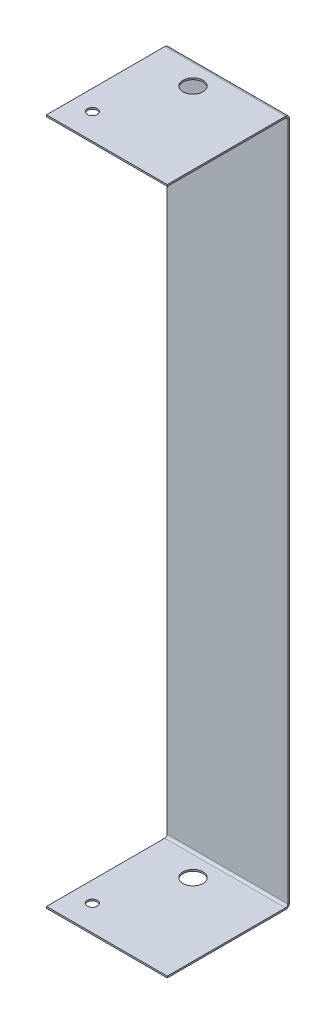
ISO-10303-21;
HEADER;
FILE_DESCRIPTION(('STEP AP214'),'2;1');
FILE_NAME('part.step','',(''),(''),'','','');
FILE_SCHEMA(('AUTOMOTIVE_DESIGN { 1 0 10303 214 1 1 1 1 }'));
ENDSEC;
DATA;
#1=APPLICATION_CONTEXT('core data for automotive mechanical design processes');
#2=APPLICATION_PROTOCOL_DEFINITION('international standard','automotive_design',2000,#1);
#3=PRODUCT_CONTEXT('',#1,'mechanical');
#4=PRODUCT('Part','Part','',(#3));
#5=PRODUCT_RELATED_PRODUCT_CATEGORY('part','',(#4));
#6=PRODUCT_DEFINITION_FORMATION('','',#4);
#7=PRODUCT_DEFINITION_CONTEXT('part definition',#1,'design');
#8=PRODUCT_DEFINITION('design','',#6,#7);
#9=PRODUCT_DEFINITION_SHAPE('','',#8);
#10=(LENGTH_UNIT() NAMED_UNIT(*) SI_UNIT(.MILLI.,.METRE.));
#11=(NAMED_UNIT(*) PLANE_ANGLE_UNIT() SI_UNIT($,.RADIAN.));
#12=(NAMED_UNIT(*) SI_UNIT($,.STERADIAN.) SOLID_ANGLE_UNIT());
#13=UNCERTAINTY_MEASURE_WITH_UNIT(LENGTH_MEASURE(1.E-05),#10,'distance_accuracy_value','');
#14=(GEOMETRIC_REPRESENTATION_CONTEXT(3) GLOBAL_UNCERTAINTY_ASSIGNED_CONTEXT((#13)) GLOBAL_UNIT_ASSIGNED_CONTEXT((#10,
#11,#12)) REPRESENTATION_CONTEXT('',''));
#15=CARTESIAN_POINT('',(0.,0.,0.));
#16=DIRECTION('',(0.,0.,1.));
#17=DIRECTION('',(1.,0.,0.));
#18=AXIS2_PLACEMENT_3D('',#15,#16,#17);
#19=CARTESIAN_POINT('',(0.,-107.908584579339,-107.991415420661));
#20=DIRECTION('',(0.,-1.,0.));
#21=DIRECTION('',(-1.,0.,0.));
#22=AXIS2_PLACEMENT_3D('',#19,#20,#21);
#23=PLANE('',#22);
#24=CARTESIAN_POINT('',(-3.80999999999362,-107.908584579338,7.08660000000422));
#25=DIRECTION('',(0.,1.,0.));
#26=DIRECTION('',(0.,0.,1.));
#27=AXIS2_PLACEMENT_3D('',#24,#25,#26);
#28=CIRCLE('',#27,3.17499999999999);
#29=CARTESIAN_POINT('',(-3.80999999999362,-107.908584579338,10.2616000000042));
#30=VERTEX_POINT('',#29);
#31=EDGE_CURVE('E341',#30,#30,#28,.T.);
#32=ORIENTED_EDGE('',*,*,#31,.F.);
#33=EDGE_LOOP('',(#32));
#34=FACE_BOUND('',#33,.T.);
#35=DIRECTION('',(0.,0.,-1.));
#36=VECTOR('',#35,1.);
#37=CARTESIAN_POINT('',(19.0499999999999,-107.908584579338,38.0585845793383));
#38=LINE('',#37,#36);
#39=CARTESIAN_POINT('',(19.0499999999999,-107.908584579338,38.0585845793383));
#40=VERTEX_POINT('',#39);
#41=CARTESIAN_POINT('',(19.0499999999999,-107.908584579338,0.736599999999948));
#42=VERTEX_POINT('',#41);
#43=EDGE_CURVE('E312',#40,#42,#38,.T.);
#44=ORIENTED_EDGE('',*,*,#43,.T.);
#45=DIRECTION('',(-1.,0.,0.));
#46=VECTOR('',#45,1.);
#47=CARTESIAN_POINT('',(0.,-107.908584579338,0.736599999999948));
#48=LINE('',#47,#46);
#49=CARTESIAN_POINT('',(-19.0500000000001,-107.908584579338,0.736600000000004));
#50=VERTEX_POINT('',#49);
#51=EDGE_CURVE('E319',#42,#50,#48,.T.);
#52=ORIENTED_EDGE('',*,*,#51,.T.);
#53=DIRECTION('',(0.,0.,1.));
#54=VECTOR('',#53,1.);
#55=CARTESIAN_POINT('',(-19.0500000000001,-107.908584579338,38.0585845793384));
#56=LINE('',#55,#54);
#57=CARTESIAN_POINT('',(-19.0500000000001,-107.908584579338,38.0585845793384));
#58=VERTEX_POINT('',#57);
#59=EDGE_CURVE('E321',#50,#58,#56,.T.);
#60=ORIENTED_EDGE('',*,*,#59,.T.);
#61=DIRECTION('',(1.,0.,0.));
#62=VECTOR('',#61,1.);
#63=CARTESIAN_POINT('',(-19.0500000000001,-107.908584579338,38.0585845793384));
#64=LINE('',#63,#62);
#65=EDGE_CURVE('E162',#58,#40,#64,.T.);
#66=ORIENTED_EDGE('',*,*,#65,.T.);
#67=EDGE_LOOP('',(#44,#52,#60,#66));
#68=FACE_BOUND('',#67,.T.);
#69=CARTESIAN_POINT('',(-12.6999999999977,-107.908584579338,29.9465999999943));
#70=DIRECTION('',(0.,1.,0.));
#71=DIRECTION('',(0.,0.,1.));
#72=AXIS2_PLACEMENT_3D('',#69,#70,#71);
#73=CIRCLE('',#72,1.58749999999999);
#74=CARTESIAN_POINT('',(-12.6999999999977,-107.908584579338,31.5340999999943));
#75=VERTEX_POINT('',#74);
#76=EDGE_CURVE('E347',#75,#75,#73,.T.);
#77=ORIENTED_EDGE('',*,*,#76,.F.);
#78=EDGE_LOOP('',(#77));
#79=FACE_BOUND('',#78,.T.);
#80=ADVANCED_FACE('F60',(#34,#68,#79),#23,.F.);
#81=CARTESIAN_POINT('',(0.,0.,-0.508000000000008));
#82=DIRECTION('',(0.,0.,-1.));
#83=DIRECTION('',(-1.,0.,0.));
#84=AXIS2_PLACEMENT_3D('',#81,#82,#83);
#85=PLANE('',#84);
#86=DIRECTION('',(0.,1.,0.));
#87=VECTOR('',#86,1.);
#88=CARTESIAN_POINT('',(19.0499999999999,-146.05,-0.508000000000064));
#89=LINE('',#88,#87);
#90=CARTESIAN_POINT('',(19.0499999999999,-107.171984579338,-0.508000000000064));
#91=VERTEX_POINT('',#90);
#92=CARTESIAN_POINT('',(19.0499999999999,107.171984579338,-0.508000000000064));
#93=VERTEX_POINT('',#92);
#94=EDGE_CURVE('E64',#91,#93,#89,.T.);
#95=ORIENTED_EDGE('',*,*,#94,.F.);
#96=DIRECTION('',(-1.,0.,0.));
#97=VECTOR('',#96,1.);
#98=CARTESIAN_POINT('',(0.,-107.171984579338,-0.508000000000064));
#99=LINE('',#98,#97);
#100=CARTESIAN_POINT('',(-19.0500000000001,-107.171984579338,-0.508000000000008));
#101=VERTEX_POINT('',#100);
#102=EDGE_CURVE('E245',#91,#101,#99,.T.);
#103=ORIENTED_EDGE('',*,*,#102,.T.);
#104=DIRECTION('',(0.,-1.,0.));
#105=VECTOR('',#104,1.);
#106=CARTESIAN_POINT('',(-19.0500000000001,-146.05,-0.508000000000008));
#107=LINE('',#106,#105);
#108=CARTESIAN_POINT('',(-19.0500000000001,107.171984579338,-0.508000000000008));
#109=VERTEX_POINT('',#108);
#110=EDGE_CURVE('E251',#109,#101,#107,.T.);
#111=ORIENTED_EDGE('',*,*,#110,.F.);
#112=DIRECTION('',(-1.,0.,0.));
#113=VECTOR('',#112,1.);
#114=CARTESIAN_POINT('',(0.,107.171984579338,-0.508000000000008));
#115=LINE('',#114,#113);
#116=EDGE_CURVE('E202',#93,#109,#115,.T.);
#117=ORIENTED_EDGE('',*,*,#116,.F.);
#118=EDGE_LOOP('',(#95,#103,#111,#117));
#119=FACE_BOUND('',#118,.T.);
#120=ADVANCED_FACE('F272',(#119),#85,.T.);
#121=CARTESIAN_POINT('',(19.0499999999999,-146.05,-0.508000000000064));
#122=DIRECTION('',(1.,0.,0.));
#123=DIRECTION('',(0.,0.,-1.));
#124=AXIS2_PLACEMENT_3D('',#121,#122,#123);
#125=PLANE('',#124);
#126=DIRECTION('',(0.,1.,0.));
#127=VECTOR('',#126,1.);
#128=CARTESIAN_POINT('',(19.0499999999999,-146.05,0.));
#129=LINE('',#128,#127);
#130=CARTESIAN_POINT('',(19.0499999999999,-107.171984579338,0.));
#131=VERTEX_POINT('',#130);
#132=CARTESIAN_POINT('',(19.05,107.171984579338,0.));
#133=VERTEX_POINT('',#132);
#134=EDGE_CURVE('E211',#131,#133,#129,.T.);
#135=ORIENTED_EDGE('',*,*,#134,.F.);
#136=DIRECTION('',(0.,0.,-1.));
#137=VECTOR('',#136,1.);
#138=CARTESIAN_POINT('',(19.0499999999999,-107.171984579338,-0.507999999999814));
#139=LINE('',#138,#137);
#140=EDGE_CURVE('E255',#131,#91,#139,.T.);
#141=ORIENTED_EDGE('',*,*,#140,.T.);
#142=ORIENTED_EDGE('',*,*,#94,.T.);
#143=DIRECTION('',(0.,0.,-1.));
#144=VECTOR('',#143,1.);
#145=CARTESIAN_POINT('',(19.0499999999999,107.171984579338,-0.507999999998315));
#146=LINE('',#145,#144);
#147=EDGE_CURVE('E212',#133,#93,#146,.T.);
#148=ORIENTED_EDGE('',*,*,#147,.F.);
#149=EDGE_LOOP('',(#135,#141,#142,#148));
#150=FACE_BOUND('',#149,.T.);
#151=ADVANCED_FACE('F269',(#150),#125,.T.);
#152=CARTESIAN_POINT('',(-19.0500000000001,-146.05,-0.508000000000008));
#153=DIRECTION('',(-1.,0.,0.));
#154=DIRECTION('',(0.,0.,1.));
#155=AXIS2_PLACEMENT_3D('',#152,#153,#154);
#156=PLANE('',#155);
#157=ORIENTED_EDGE('',*,*,#110,.T.);
#158=DIRECTION('',(0.,0.,1.));
#159=VECTOR('',#158,1.);
#160=CARTESIAN_POINT('',(-19.0500000000001,-107.171984579338,-0.507999999999731));
#161=LINE('',#160,#159);
#162=CARTESIAN_POINT('',(-19.0500000000001,-107.171984579338,0.));
#163=VERTEX_POINT('',#162);
#164=EDGE_CURVE('E14',#101,#163,#161,.T.);
#165=ORIENTED_EDGE('',*,*,#164,.T.);
#166=DIRECTION('',(0.,-1.,0.));
#167=VECTOR('',#166,1.);
#168=CARTESIAN_POINT('',(-19.0500000000001,-146.05,0.));
#169=LINE('',#168,#167);
#170=CARTESIAN_POINT('',(-19.05,107.171984579338,0.));
#171=VERTEX_POINT('',#170);
#172=EDGE_CURVE('E210',#171,#163,#169,.T.);
#173=ORIENTED_EDGE('',*,*,#172,.F.);
#174=DIRECTION('',(0.,0.,1.));
#175=VECTOR('',#174,1.);
#176=CARTESIAN_POINT('',(-19.0500000000001,107.171984579338,-0.507999999998232));
#177=LINE('',#176,#175);
#178=EDGE_CURVE('E215',#109,#171,#177,.T.);
#179=ORIENTED_EDGE('',*,*,#178,.F.);
#180=EDGE_LOOP('',(#157,#165,#173,#179));
#181=FACE_BOUND('',#180,.T.);
#182=ADVANCED_FACE('F62',(#181),#156,.T.);
#183=CARTESIAN_POINT('',(19.05,108.416584579339,-254.041415420661));
#184=DIRECTION('',(1.,0.,0.));
#185=DIRECTION('',(0.,1.,0.));
#186=AXIS2_PLACEMENT_3D('',#183,#184,#185);
#187=PLANE('',#186);
#188=DIRECTION('',(0.,0.,1.));
#189=VECTOR('',#188,1.);
#190=CARTESIAN_POINT('',(19.05,107.908584579339,-254.041415420661));
#191=LINE('',#190,#189);
#192=CARTESIAN_POINT('',(19.05,107.908584579338,0.736599999999948));
#193=VERTEX_POINT('',#192);
#194=CARTESIAN_POINT('',(19.05,107.908584579338,38.0585845793385));
#195=VERTEX_POINT('',#194);
#196=EDGE_CURVE('E228',#193,#195,#191,.T.);
#197=ORIENTED_EDGE('',*,*,#196,.F.);
#198=DIRECTION('',(0.,1.,0.));
#199=VECTOR('',#198,1.);
#200=CARTESIAN_POINT('',(19.05,108.416584579337,0.736600000000004));
#201=LINE('',#200,#199);
#202=CARTESIAN_POINT('',(19.05,108.416584579338,0.736600000000032));
#203=VERTEX_POINT('',#202);
#204=EDGE_CURVE('E237',#193,#203,#201,.T.);
#205=ORIENTED_EDGE('',*,*,#204,.T.);
#206=DIRECTION('',(0.,0.,1.));
#207=VECTOR('',#206,1.);
#208=CARTESIAN_POINT('',(19.05,108.416584579339,-254.041415420661));
#209=LINE('',#208,#207);
#210=CARTESIAN_POINT('',(19.05,108.416584579338,38.0585845793385));
#211=VERTEX_POINT('',#210);
#212=EDGE_CURVE('E223',#203,#211,#209,.T.);
#213=ORIENTED_EDGE('',*,*,#212,.T.);
#214=DIRECTION('',(0.,-1.,0.));
#215=VECTOR('',#214,1.);
#216=CARTESIAN_POINT('',(19.05,108.416584579338,38.0585845793385));
#217=LINE('',#216,#215);
#218=EDGE_CURVE('E232',#211,#195,#217,.T.);
#219=ORIENTED_EDGE('',*,*,#218,.T.);
#220=EDGE_LOOP('',(#197,#205,#213,#219));
#221=FACE_BOUND('',#220,.T.);
#222=ADVANCED_FACE('F293',(#221),#187,.T.);
#223=CARTESIAN_POINT('',(-19.05,108.416584579339,-254.041415420661));
#224=DIRECTION('',(-1.,0.,0.));
#225=DIRECTION('',(0.,-1.,0.));
#226=AXIS2_PLACEMENT_3D('',#223,#224,#225);
#227=PLANE('',#226);
#228=DIRECTION('',(0.,0.,-1.));
#229=VECTOR('',#228,1.);
#230=CARTESIAN_POINT('',(-19.05,108.416584579339,-254.041415420661));
#231=LINE('',#230,#229);
#232=CARTESIAN_POINT('',(-19.05,108.416584579338,38.0585845793386));
#233=VERTEX_POINT('',#232);
#234=CARTESIAN_POINT('',(-19.05,108.416584579338,0.736600000000004));
#235=VERTEX_POINT('',#234);
#236=EDGE_CURVE('E222',#233,#235,#231,.T.);
#237=ORIENTED_EDGE('',*,*,#236,.T.);
#238=DIRECTION('',(0.,-1.,0.));
#239=VECTOR('',#238,1.);
#240=CARTESIAN_POINT('',(-19.05,108.416584579337,0.736600000000004));
#241=LINE('',#240,#239);
#242=CARTESIAN_POINT('',(-19.05,107.908584579338,0.736600000000004));
#243=VERTEX_POINT('',#242);
#244=EDGE_CURVE('E242',#235,#243,#241,.T.);
#245=ORIENTED_EDGE('',*,*,#244,.T.);
#246=DIRECTION('',(0.,0.,-1.));
#247=VECTOR('',#246,1.);
#248=CARTESIAN_POINT('',(-19.05,107.908584579339,-254.041415420661));
#249=LINE('',#248,#247);
#250=CARTESIAN_POINT('',(-19.05,107.908584579338,38.0585845793386));
#251=VERTEX_POINT('',#250);
#252=EDGE_CURVE('E227',#251,#243,#249,.T.);
#253=ORIENTED_EDGE('',*,*,#252,.F.);
#254=DIRECTION('',(0.,-1.,0.));
#255=VECTOR('',#254,1.);
#256=CARTESIAN_POINT('',(-19.05,108.416584579338,38.0585845793386));
#257=LINE('',#256,#255);
#258=EDGE_CURVE('E229',#233,#251,#257,.T.);
#259=ORIENTED_EDGE('',*,*,#258,.F.);
#260=EDGE_LOOP('',(#237,#245,#253,#259));
#261=FACE_BOUND('',#260,.T.);
#262=ADVANCED_FACE('F285',(#261),#227,.T.);
#263=CARTESIAN_POINT('',(0.,108.416584579339,-107.991415420662));
#264=DIRECTION('',(0.,1.,0.));
#265=DIRECTION('',(-1.,0.,0.));
#266=AXIS2_PLACEMENT_3D('',#263,#264,#265);
#267=PLANE('',#266);
#268=CARTESIAN_POINT('',(-12.6999999999977,108.416584579339,29.9465999999943));
#269=DIRECTION('',(0.,-1.,0.));
#270=DIRECTION('',(0.,0.,-1.));
#271=AXIS2_PLACEMENT_3D('',#268,#269,#270);
#272=CIRCLE('',#271,1.5875);
#273=CARTESIAN_POINT('',(-12.6999999999977,108.416584579339,28.3590999999943));
#274=VERTEX_POINT('',#273);
#275=EDGE_CURVE('E332',#274,#274,#272,.T.);
#276=ORIENTED_EDGE('',*,*,#275,.T.);
#277=EDGE_LOOP('',(#276));
#278=FACE_BOUND('',#277,.T.);
#279=CARTESIAN_POINT('',(-3.8099999999936,108.416584579339,7.08660000000427));
#280=DIRECTION('',(0.,-1.,0.));
#281=DIRECTION('',(0.,0.,-1.));
#282=AXIS2_PLACEMENT_3D('',#279,#280,#281);
#283=CIRCLE('',#282,3.175);
#284=CARTESIAN_POINT('',(-3.8099999999936,108.416584579339,3.91160000000427));
#285=VERTEX_POINT('',#284);
#286=EDGE_CURVE('E186',#285,#285,#283,.T.);
#287=ORIENTED_EDGE('',*,*,#286,.T.);
#288=EDGE_LOOP('',(#287));
#289=FACE_BOUND('',#288,.T.);
#290=ORIENTED_EDGE('',*,*,#212,.F.);
#291=DIRECTION('',(-1.,0.,0.));
#292=VECTOR('',#291,1.);
#293=CARTESIAN_POINT('',(0.,108.416584579338,0.736599999999976));
#294=LINE('',#293,#292);
#295=EDGE_CURVE('E231',#203,#235,#294,.T.);
#296=ORIENTED_EDGE('',*,*,#295,.T.);
#297=ORIENTED_EDGE('',*,*,#236,.F.);
#298=DIRECTION('',(-1.,0.,0.));
#299=VECTOR('',#298,1.);
#300=CARTESIAN_POINT('',(-19.05,108.416584579338,38.0585845793386));
#301=LINE('',#300,#299);
#302=EDGE_CURVE('E219',#211,#233,#301,.T.);
#303=ORIENTED_EDGE('',*,*,#302,.F.);
#304=EDGE_LOOP('',(#290,#296,#297,#303));
#305=FACE_BOUND('',#304,.T.);
#306=ADVANCED_FACE('F282',(#278,#289,#305),#267,.T.);
#307=CARTESIAN_POINT('',(-19.05,108.416584579338,38.0585845793386));
#308=DIRECTION('',(0.,0.,1.));
#309=DIRECTION('',(0.,-1.,0.));
#310=AXIS2_PLACEMENT_3D('',#307,#308,#309);
#311=PLANE('',#310);
#312=DIRECTION('',(-1.,0.,0.));
#313=VECTOR('',#312,1.);
#314=CARTESIAN_POINT('',(-19.05,107.908584579338,38.0585845793386));
#315=LINE('',#314,#313);
#316=EDGE_CURVE('E224',#195,#251,#315,.T.);
#317=ORIENTED_EDGE('',*,*,#316,.F.);
#318=ORIENTED_EDGE('',*,*,#218,.F.);
#319=ORIENTED_EDGE('',*,*,#302,.T.);
#320=ORIENTED_EDGE('',*,*,#258,.T.);
#321=EDGE_LOOP('',(#317,#318,#319,#320));
#322=FACE_BOUND('',#321,.T.);
#323=ADVANCED_FACE('F289',(#322),#311,.T.);
#324=CARTESIAN_POINT('',(0.,107.908584579339,-107.991415420662));
#325=DIRECTION('',(0.,1.,0.));
#326=DIRECTION('',(-1.,0.,0.));
#327=AXIS2_PLACEMENT_3D('',#324,#325,#326);
#328=PLANE('',#327);
#329=CARTESIAN_POINT('',(-12.6999999999977,107.908584579338,29.9465999999943));
#330=DIRECTION('',(0.,-1.,0.));
#331=DIRECTION('',(0.,0.,-1.));
#332=AXIS2_PLACEMENT_3D('',#329,#330,#331);
#333=CIRCLE('',#332,1.58749999999999);
#334=CARTESIAN_POINT('',(-12.6999999999977,107.908584579338,28.3590999999943));
#335=VERTEX_POINT('',#334);
#336=EDGE_CURVE('E335',#335,#335,#333,.T.);
#337=ORIENTED_EDGE('',*,*,#336,.F.);
#338=EDGE_LOOP('',(#337));
#339=FACE_BOUND('',#338,.T.);
#340=CARTESIAN_POINT('',(-3.8099999999936,107.908584579338,7.08660000000427));
#341=DIRECTION('',(0.,-1.,0.));
#342=DIRECTION('',(0.,0.,-1.));
#343=AXIS2_PLACEMENT_3D('',#340,#341,#342);
#344=CIRCLE('',#343,3.17499999999999);
#345=CARTESIAN_POINT('',(-3.8099999999936,107.908584579338,3.91160000000429));
#346=VERTEX_POINT('',#345);
#347=EDGE_CURVE('E329',#346,#346,#344,.T.);
#348=ORIENTED_EDGE('',*,*,#347,.F.);
#349=EDGE_LOOP('',(#348));
#350=FACE_BOUND('',#349,.T.);
#351=DIRECTION('',(-1.,0.,0.));
#352=VECTOR('',#351,1.);
#353=CARTESIAN_POINT('',(0.,107.908584579338,0.736599999999976));
#354=LINE('',#353,#352);
#355=EDGE_CURVE('E240',#193,#243,#354,.T.);
#356=ORIENTED_EDGE('',*,*,#355,.F.);
#357=ORIENTED_EDGE('',*,*,#196,.T.);
#358=ORIENTED_EDGE('',*,*,#316,.T.);
#359=ORIENTED_EDGE('',*,*,#252,.T.);
#360=EDGE_LOOP('',(#356,#357,#358,#359));
#361=FACE_BOUND('',#360,.T.);
#362=ADVANCED_FACE('F385',(#339,#350,#361),#328,.F.);
#363=CARTESIAN_POINT('',(0.,0.,0.));
#364=DIRECTION('',(0.,0.,-1.));
#365=DIRECTION('',(-1.,0.,0.));
#366=AXIS2_PLACEMENT_3D('',#363,#364,#365);
#367=PLANE('',#366);
#368=DIRECTION('',(-1.,0.,0.));
#369=VECTOR('',#368,1.);
#370=CARTESIAN_POINT('',(0.,-107.171984579338,0.));
#371=LINE('',#370,#369);
#372=EDGE_CURVE('E69',#131,#163,#371,.T.);
#373=ORIENTED_EDGE('',*,*,#372,.F.);
#374=ORIENTED_EDGE('',*,*,#134,.T.);
#375=DIRECTION('',(-1.,0.,0.));
#376=VECTOR('',#375,1.);
#377=CARTESIAN_POINT('',(0.,107.171984579338,0.));
#378=LINE('',#377,#376);
#379=EDGE_CURVE('E207',#133,#171,#378,.T.);
#380=ORIENTED_EDGE('',*,*,#379,.T.);
#381=ORIENTED_EDGE('',*,*,#172,.T.);
#382=EDGE_LOOP('',(#373,#374,#380,#381));
#383=FACE_BOUND('',#382,.T.);
#384=ADVANCED_FACE('F298',(#383),#367,.F.);
#385=CARTESIAN_POINT('',(19.05,107.171984579338,0.736599999999921));
#386=DIRECTION('',(1.,0.,0.));
#387=DIRECTION('',(0.,0.,-1.));
#388=AXIS2_PLACEMENT_3D('',#385,#386,#387);
#389=PLANE('',#388);
#390=ORIENTED_EDGE('',*,*,#204,.F.);
#391=CARTESIAN_POINT('',(19.05,107.171984579338,0.736599999999921));
#392=DIRECTION('',(1.,0.,0.));
#393=DIRECTION('',(0.,0.,-1.));
#394=AXIS2_PLACEMENT_3D('',#391,#392,#393);
#395=CIRCLE('',#394,0.7366);
#396=EDGE_CURVE('E193',#193,#133,#395,.F.);
#397=ORIENTED_EDGE('',*,*,#396,.T.);
#398=ORIENTED_EDGE('',*,*,#147,.T.);
#399=CARTESIAN_POINT('',(19.05,107.171984579338,0.736599999999921));
#400=DIRECTION('',(-1.,0.,0.));
#401=DIRECTION('',(0.,0.,-1.));
#402=AXIS2_PLACEMENT_3D('',#399,#400,#401);
#403=CIRCLE('',#402,1.2446);
#404=EDGE_CURVE('E197',#203,#93,#403,.T.);
#405=ORIENTED_EDGE('',*,*,#404,.F.);
#406=EDGE_LOOP('',(#390,#397,#398,#405));
#407=FACE_BOUND('',#406,.T.);
#408=ADVANCED_FACE('F276',(#407),#389,.T.);
#409=CARTESIAN_POINT('',(-19.05,107.171984579338,0.736600000000004));
#410=DIRECTION('',(-1.,0.,0.));
#411=DIRECTION('',(0.,0.,1.));
#412=AXIS2_PLACEMENT_3D('',#409,#410,#411);
#413=PLANE('',#412);
#414=CARTESIAN_POINT('',(-19.05,107.171984579338,0.736600000000004));
#415=DIRECTION('',(1.,0.,0.));
#416=DIRECTION('',(0.,0.,-1.));
#417=AXIS2_PLACEMENT_3D('',#414,#415,#416);
#418=CIRCLE('',#417,0.7366);
#419=EDGE_CURVE('E200',#171,#243,#418,.T.);
#420=ORIENTED_EDGE('',*,*,#419,.T.);
#421=ORIENTED_EDGE('',*,*,#244,.F.);
#422=CARTESIAN_POINT('',(-19.05,107.171984579338,0.736600000000004));
#423=DIRECTION('',(1.,0.,0.));
#424=DIRECTION('',(0.,0.,1.));
#425=AXIS2_PLACEMENT_3D('',#422,#423,#424);
#426=CIRCLE('',#425,1.2446);
#427=EDGE_CURVE('E85',#109,#235,#426,.T.);
#428=ORIENTED_EDGE('',*,*,#427,.F.);
#429=ORIENTED_EDGE('',*,*,#178,.T.);
#430=EDGE_LOOP('',(#420,#421,#428,#429));
#431=FACE_BOUND('',#430,.T.);
#432=ADVANCED_FACE('F300',(#431),#413,.T.);
#433=CARTESIAN_POINT('',(-38.1351451548194,107.171984579338,0.736599999999921));
#434=DIRECTION('',(1.,0.,0.));
#435=DIRECTION('',(0.,0.,-1.));
#436=AXIS2_PLACEMENT_3D('',#433,#434,#435);
#437=CYLINDRICAL_SURFACE('',#436,1.2446);
#438=ORIENTED_EDGE('',*,*,#116,.T.);
#439=ORIENTED_EDGE('',*,*,#427,.T.);
#440=ORIENTED_EDGE('',*,*,#295,.F.);
#441=ORIENTED_EDGE('',*,*,#404,.T.);
#442=EDGE_LOOP('',(#438,#439,#440,#441));
#443=FACE_BOUND('',#442,.T.);
#444=ADVANCED_FACE('F279',(#443),#437,.T.);
#445=CARTESIAN_POINT('',(-38.1351451548194,107.171984579338,0.736599999999921));
#446=DIRECTION('',(1.,0.,0.));
#447=DIRECTION('',(0.,0.,-1.));
#448=AXIS2_PLACEMENT_3D('',#445,#446,#447);
#449=CYLINDRICAL_SURFACE('',#448,0.7366);
#450=ORIENTED_EDGE('',*,*,#379,.F.);
#451=ORIENTED_EDGE('',*,*,#396,.F.);
#452=ORIENTED_EDGE('',*,*,#355,.T.);
#453=ORIENTED_EDGE('',*,*,#419,.F.);
#454=EDGE_LOOP('',(#450,#451,#452,#453));
#455=FACE_BOUND('',#454,.T.);
#456=ADVANCED_FACE('F296',(#455),#449,.F.);
#457=CARTESIAN_POINT('',(19.0499999999999,-107.171984579338,0.736599999999921));
#458=DIRECTION('',(1.,0.,0.));
#459=DIRECTION('',(0.,0.,-1.));
#460=AXIS2_PLACEMENT_3D('',#457,#458,#459);
#461=PLANE('',#460);
#462=ORIENTED_EDGE('',*,*,#140,.F.);
#463=CARTESIAN_POINT('',(19.0499999999999,-107.171984579338,0.736599999999921));
#464=DIRECTION('',(-1.,0.,0.));
#465=DIRECTION('',(0.,0.,1.));
#466=AXIS2_PLACEMENT_3D('',#463,#464,#465);
#467=CIRCLE('',#466,0.7366);
#468=EDGE_CURVE('E169',#131,#42,#467,.T.);
#469=ORIENTED_EDGE('',*,*,#468,.T.);
#470=DIRECTION('',(0.,-1.,0.));
#471=VECTOR('',#470,1.);
#472=CARTESIAN_POINT('',(19.0499999999999,-108.416584579338,0.736600000000004));
#473=LINE('',#472,#471);
#474=CARTESIAN_POINT('',(19.0499999999999,-108.416584579338,0.736600000000004));
#475=VERTEX_POINT('',#474);
#476=EDGE_CURVE('E176',#42,#475,#473,.T.);
#477=ORIENTED_EDGE('',*,*,#476,.T.);
#478=CARTESIAN_POINT('',(19.0499999999999,-107.171984579338,0.736599999999921));
#479=DIRECTION('',(-1.,0.,0.));
#480=DIRECTION('',(0.,0.,-1.));
#481=AXIS2_PLACEMENT_3D('',#478,#479,#480);
#482=CIRCLE('',#481,1.2446);
#483=EDGE_CURVE('E187',#91,#475,#482,.T.);
#484=ORIENTED_EDGE('',*,*,#483,.F.);
#485=EDGE_LOOP('',(#462,#469,#477,#484));
#486=FACE_BOUND('',#485,.T.);
#487=ADVANCED_FACE('F314',(#486),#461,.T.);
#488=CARTESIAN_POINT('',(-19.0500000000001,-107.171984579338,0.736600000000004));
#489=DIRECTION('',(-1.,0.,0.));
#490=DIRECTION('',(0.,0.,1.));
#491=AXIS2_PLACEMENT_3D('',#488,#489,#490);
#492=PLANE('',#491);
#493=CARTESIAN_POINT('',(-19.0500000000001,-107.171984579338,0.736600000000004));
#494=DIRECTION('',(-1.,0.,0.));
#495=DIRECTION('',(0.,0.,1.));
#496=AXIS2_PLACEMENT_3D('',#493,#494,#495);
#497=CIRCLE('',#496,0.7366);
#498=EDGE_CURVE('E77',#50,#163,#497,.F.);
#499=ORIENTED_EDGE('',*,*,#498,.T.);
#500=ORIENTED_EDGE('',*,*,#164,.F.);
#501=CARTESIAN_POINT('',(-19.0500000000001,-107.171984579338,0.736600000000004));
#502=DIRECTION('',(1.,0.,0.));
#503=DIRECTION('',(0.,0.,1.));
#504=AXIS2_PLACEMENT_3D('',#501,#502,#503);
#505=CIRCLE('',#504,1.2446);
#506=CARTESIAN_POINT('',(-19.0500000000001,-108.416584579338,0.736599999999921));
#507=VERTEX_POINT('',#506);
#508=EDGE_CURVE('E190',#507,#101,#505,.T.);
#509=ORIENTED_EDGE('',*,*,#508,.F.);
#510=DIRECTION('',(0.,1.,0.));
#511=VECTOR('',#510,1.);
#512=CARTESIAN_POINT('',(-19.0500000000001,-108.416584579338,0.736599999999921));
#513=LINE('',#512,#511);
#514=EDGE_CURVE('E158',#507,#50,#513,.T.);
#515=ORIENTED_EDGE('',*,*,#514,.T.);
#516=EDGE_LOOP('',(#499,#500,#509,#515));
#517=FACE_BOUND('',#516,.T.);
#518=ADVANCED_FACE('F303',(#517),#492,.T.);
#519=CARTESIAN_POINT('',(38.1351451548194,-107.171984579338,0.736600000000004));
#520=DIRECTION('',(-1.,0.,0.));
#521=DIRECTION('',(0.,0.,1.));
#522=AXIS2_PLACEMENT_3D('',#519,#520,#521);
#523=CYLINDRICAL_SURFACE('',#522,1.2446);
#524=DIRECTION('',(-1.,0.,0.));
#525=VECTOR('',#524,1.);
#526=CARTESIAN_POINT('',(0.,-108.416584579338,0.736599999999948));
#527=LINE('',#526,#525);
#528=EDGE_CURVE('E184',#475,#507,#527,.T.);
#529=ORIENTED_EDGE('',*,*,#528,.T.);
#530=ORIENTED_EDGE('',*,*,#508,.T.);
#531=ORIENTED_EDGE('',*,*,#102,.F.);
#532=ORIENTED_EDGE('',*,*,#483,.T.);
#533=EDGE_LOOP('',(#529,#530,#531,#532));
#534=FACE_BOUND('',#533,.T.);
#535=ADVANCED_FACE('F305',(#534),#523,.T.);
#536=CARTESIAN_POINT('',(38.1351451548194,-107.171984579338,0.736600000000004));
#537=DIRECTION('',(-1.,0.,0.));
#538=DIRECTION('',(0.,0.,1.));
#539=AXIS2_PLACEMENT_3D('',#536,#537,#538);
#540=CYLINDRICAL_SURFACE('',#539,0.7366);
#541=ORIENTED_EDGE('',*,*,#51,.F.);
#542=ORIENTED_EDGE('',*,*,#468,.F.);
#543=ORIENTED_EDGE('',*,*,#372,.T.);
#544=ORIENTED_EDGE('',*,*,#498,.F.);
#545=EDGE_LOOP('',(#541,#542,#543,#544));
#546=FACE_BOUND('',#545,.T.);
#547=ADVANCED_FACE('F317',(#546),#540,.F.);
#548=CARTESIAN_POINT('',(-19.0500000000001,-108.416584579338,38.0585845793384));
#549=DIRECTION('',(0.,0.,1.));
#550=DIRECTION('',(0.,-1.,0.));
#551=AXIS2_PLACEMENT_3D('',#548,#549,#550);
#552=PLANE('',#551);
#553=ORIENTED_EDGE('',*,*,#65,.F.);
#554=DIRECTION('',(0.,1.,0.));
#555=VECTOR('',#554,1.);
#556=CARTESIAN_POINT('',(-19.0500000000001,-108.416584579338,38.0585845793384));
#557=LINE('',#556,#555);
#558=CARTESIAN_POINT('',(-19.0500000000001,-108.416584579338,38.0585845793384));
#559=VERTEX_POINT('',#558);
#560=EDGE_CURVE('E156',#559,#58,#557,.T.);
#561=ORIENTED_EDGE('',*,*,#560,.F.);
#562=DIRECTION('',(1.,0.,0.));
#563=VECTOR('',#562,1.);
#564=CARTESIAN_POINT('',(-19.0500000000001,-108.416584579338,38.0585845793384));
#565=LINE('',#564,#563);
#566=CARTESIAN_POINT('',(19.0499999999999,-108.416584579338,38.0585845793384));
#567=VERTEX_POINT('',#566);
#568=EDGE_CURVE('E167',#559,#567,#565,.T.);
#569=ORIENTED_EDGE('',*,*,#568,.T.);
#570=DIRECTION('',(0.,1.,0.));
#571=VECTOR('',#570,1.);
#572=CARTESIAN_POINT('',(19.0499999999999,-108.416584579338,38.0585845793384));
#573=LINE('',#572,#571);
#574=EDGE_CURVE('E175',#567,#40,#573,.T.);
#575=ORIENTED_EDGE('',*,*,#574,.T.);
#576=EDGE_LOOP('',(#553,#561,#569,#575));
#577=FACE_BOUND('',#576,.T.);
#578=ADVANCED_FACE('F166',(#577),#552,.T.);
#579=CARTESIAN_POINT('',(0.,-108.416584579339,-107.991415420661));
#580=DIRECTION('',(0.,-1.,0.));
#581=DIRECTION('',(-1.,0.,0.));
#582=AXIS2_PLACEMENT_3D('',#579,#580,#581);
#583=PLANE('',#582);
#584=CARTESIAN_POINT('',(-12.6999999999977,-108.416584579339,29.9465999999944));
#585=DIRECTION('',(0.,1.,0.));
#586=DIRECTION('',(0.,0.,1.));
#587=AXIS2_PLACEMENT_3D('',#584,#585,#586);
#588=CIRCLE('',#587,1.5875);
#589=CARTESIAN_POINT('',(-12.6999999999977,-108.416584579339,31.5340999999944));
#590=VERTEX_POINT('',#589);
#591=EDGE_CURVE('E344',#590,#590,#588,.T.);
#592=ORIENTED_EDGE('',*,*,#591,.T.);
#593=EDGE_LOOP('',(#592));
#594=FACE_BOUND('',#593,.T.);
#595=CARTESIAN_POINT('',(-3.80999999999362,-108.416584579339,7.08660000000422));
#596=DIRECTION('',(0.,1.,0.));
#597=DIRECTION('',(0.,0.,1.));
#598=AXIS2_PLACEMENT_3D('',#595,#596,#597);
#599=CIRCLE('',#598,3.175);
#600=CARTESIAN_POINT('',(-3.80999999999362,-108.416584579339,10.2616000000042));
#601=VERTEX_POINT('',#600);
#602=EDGE_CURVE('E338',#601,#601,#599,.T.);
#603=ORIENTED_EDGE('',*,*,#602,.T.);
#604=EDGE_LOOP('',(#603));
#605=FACE_BOUND('',#604,.T.);
#606=ORIENTED_EDGE('',*,*,#528,.F.);
#607=DIRECTION('',(0.,0.,-1.));
#608=VECTOR('',#607,1.);
#609=CARTESIAN_POINT('',(19.0499999999999,-108.416584579338,38.0585845793384));
#610=LINE('',#609,#608);
#611=EDGE_CURVE('E174',#567,#475,#610,.T.);
#612=ORIENTED_EDGE('',*,*,#611,.F.);
#613=ORIENTED_EDGE('',*,*,#568,.F.);
#614=DIRECTION('',(0.,0.,1.));
#615=VECTOR('',#614,1.);
#616=CARTESIAN_POINT('',(-19.0500000000001,-108.416584579338,38.0585845793384));
#617=LINE('',#616,#615);
#618=EDGE_CURVE('E153',#507,#559,#617,.T.);
#619=ORIENTED_EDGE('',*,*,#618,.F.);
#620=EDGE_LOOP('',(#606,#612,#613,#619));
#621=FACE_BOUND('',#620,.T.);
#622=ADVANCED_FACE('F172',(#594,#605,#621),#583,.T.);
#623=CARTESIAN_POINT('',(19.0499999999999,-108.416584579338,38.0585845793384));
#624=DIRECTION('',(1.,0.,0.));
#625=DIRECTION('',(0.,-1.,0.));
#626=AXIS2_PLACEMENT_3D('',#623,#624,#625);
#627=PLANE('',#626);
#628=ORIENTED_EDGE('',*,*,#476,.F.);
#629=ORIENTED_EDGE('',*,*,#43,.F.);
#630=ORIENTED_EDGE('',*,*,#574,.F.);
#631=ORIENTED_EDGE('',*,*,#611,.T.);
#632=EDGE_LOOP('',(#628,#629,#630,#631));
#633=FACE_BOUND('',#632,.T.);
#634=ADVANCED_FACE('F309',(#633),#627,.T.);
#635=CARTESIAN_POINT('',(-19.0500000000001,-108.416584579338,38.0585845793384));
#636=DIRECTION('',(-1.,0.,0.));
#637=DIRECTION('',(0.,1.,0.));
#638=AXIS2_PLACEMENT_3D('',#635,#636,#637);
#639=PLANE('',#638);
#640=ORIENTED_EDGE('',*,*,#514,.F.);
#641=ORIENTED_EDGE('',*,*,#618,.T.);
#642=ORIENTED_EDGE('',*,*,#560,.T.);
#643=ORIENTED_EDGE('',*,*,#59,.F.);
#644=EDGE_LOOP('',(#640,#641,#642,#643));
#645=FACE_BOUND('',#644,.T.);
#646=ADVANCED_FACE('F155',(#645),#639,.T.);
#647=CARTESIAN_POINT('',(-3.8099999999936,107.908584579338,7.08660000000427));
#648=DIRECTION('',(0.,-1.,0.));
#649=DIRECTION('',(0.,0.,-1.));
#650=AXIS2_PLACEMENT_3D('',#647,#648,#649);
#651=CYLINDRICAL_SURFACE('',#650,3.17499999999999);
#652=ORIENTED_EDGE('',*,*,#286,.F.);
#653=EDGE_LOOP('',(#652));
#654=FACE_BOUND('',#653,.T.);
#655=ORIENTED_EDGE('',*,*,#347,.T.);
#656=EDGE_LOOP('',(#655));
#657=FACE_BOUND('',#656,.T.);
#658=ADVANCED_FACE('F366',(#654,#657),#651,.F.);
#659=CARTESIAN_POINT('',(-12.6999999999977,107.908584579338,29.9465999999943));
#660=DIRECTION('',(0.,-1.,0.));
#661=DIRECTION('',(0.,0.,-1.));
#662=AXIS2_PLACEMENT_3D('',#659,#660,#661);
#663=CYLINDRICAL_SURFACE('',#662,1.58749999999999);
#664=ORIENTED_EDGE('',*,*,#275,.F.);
#665=EDGE_LOOP('',(#664));
#666=FACE_BOUND('',#665,.T.);
#667=ORIENTED_EDGE('',*,*,#336,.T.);
#668=EDGE_LOOP('',(#667));
#669=FACE_BOUND('',#668,.T.);
#670=ADVANCED_FACE('F476',(#666,#669),#663,.F.);
#671=CARTESIAN_POINT('',(-3.80999999999362,-107.908584579338,7.08660000000422));
#672=DIRECTION('',(0.,1.,0.));
#673=DIRECTION('',(0.,0.,1.));
#674=AXIS2_PLACEMENT_3D('',#671,#672,#673);
#675=CYLINDRICAL_SURFACE('',#674,3.17499999999999);
#676=ORIENTED_EDGE('',*,*,#602,.F.);
#677=EDGE_LOOP('',(#676));
#678=FACE_BOUND('',#677,.T.);
#679=ORIENTED_EDGE('',*,*,#31,.T.);
#680=EDGE_LOOP('',(#679));
#681=FACE_BOUND('',#680,.T.);
#682=ADVANCED_FACE('F484',(#678,#681),#675,.F.);
#683=CARTESIAN_POINT('',(-12.6999999999977,-107.908584579338,29.9465999999943));
#684=DIRECTION('',(0.,1.,0.));
#685=DIRECTION('',(0.,0.,1.));
#686=AXIS2_PLACEMENT_3D('',#683,#684,#685);
#687=CYLINDRICAL_SURFACE('',#686,1.58749999999999);
#688=ORIENTED_EDGE('',*,*,#591,.F.);
#689=EDGE_LOOP('',(#688));
#690=FACE_BOUND('',#689,.T.);
#691=ORIENTED_EDGE('',*,*,#76,.T.);
#692=EDGE_LOOP('',(#691));
#693=FACE_BOUND('',#692,.T.);
#694=ADVANCED_FACE('F351',(#690,#693),#687,.F.);
#695=CLOSED_SHELL('',(#80,#120,#151,#182,#222,#262,#306,#323,#362,#384,#408,#432,#444,#456,#487,
#518,#535,#547,#578,#622,#634,#646,#658,#670,#682,#694));
#696=MANIFOLD_SOLID_BREP('B2',#695);
#697=ADVANCED_BREP_SHAPE_REPRESENTATION('',(#18,#696),#14);
#698=SHAPE_DEFINITION_REPRESENTATION(#9,#697);
ENDSEC;
END-ISO-10303-21;
